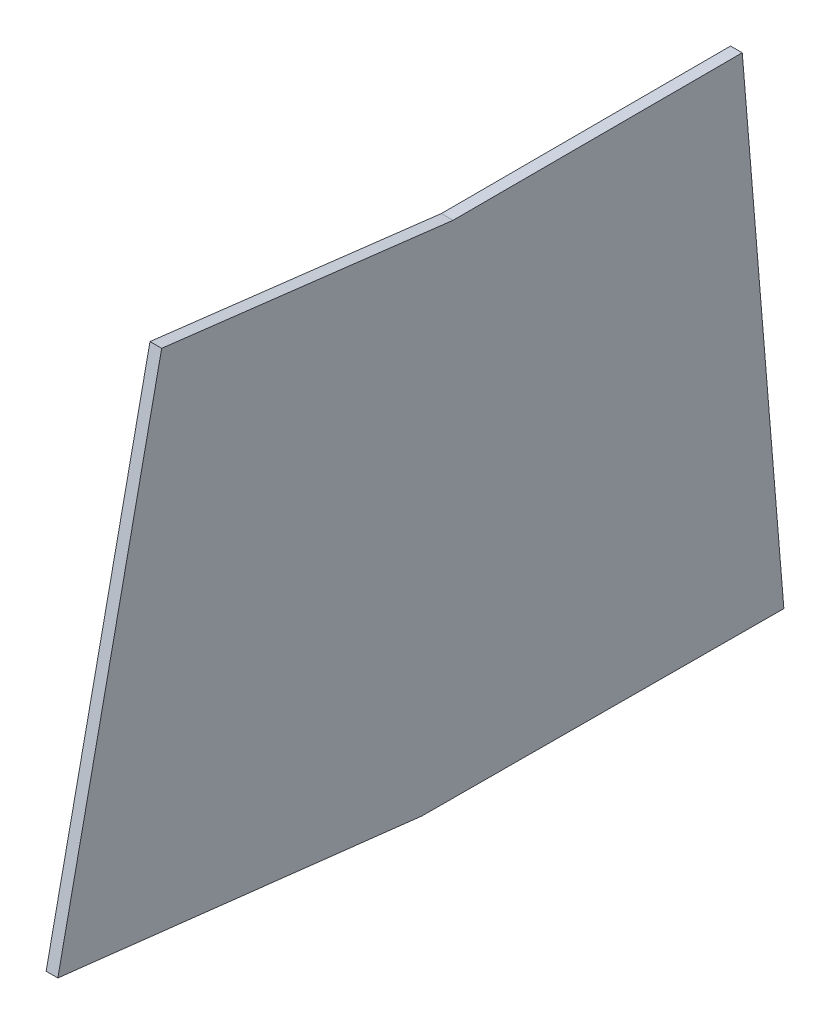
ISO-10303-21;
HEADER;
FILE_DESCRIPTION(('STEP AP214'),'2;1');
FILE_NAME('part.step','',(''),(''),'','','');
FILE_SCHEMA(('AUTOMOTIVE_DESIGN { 1 0 10303 214 1 1 1 1 }'));
ENDSEC;
DATA;
#1=APPLICATION_CONTEXT('core data for automotive mechanical design processes');
#2=APPLICATION_PROTOCOL_DEFINITION('international standard','automotive_design',2000,#1);
#3=PRODUCT_CONTEXT('',#1,'mechanical');
#4=PRODUCT('Part','Part','',(#3));
#5=PRODUCT_RELATED_PRODUCT_CATEGORY('part','',(#4));
#6=PRODUCT_DEFINITION_FORMATION('','',#4);
#7=PRODUCT_DEFINITION_CONTEXT('part definition',#1,'design');
#8=PRODUCT_DEFINITION('design','',#6,#7);
#9=PRODUCT_DEFINITION_SHAPE('','',#8);
#10=(LENGTH_UNIT() NAMED_UNIT(*) SI_UNIT(.MILLI.,.METRE.));
#11=(NAMED_UNIT(*) PLANE_ANGLE_UNIT() SI_UNIT($,.RADIAN.));
#12=(NAMED_UNIT(*) SI_UNIT($,.STERADIAN.) SOLID_ANGLE_UNIT());
#13=UNCERTAINTY_MEASURE_WITH_UNIT(LENGTH_MEASURE(1.E-05),#10,'distance_accuracy_value','');
#14=(GEOMETRIC_REPRESENTATION_CONTEXT(3) GLOBAL_UNCERTAINTY_ASSIGNED_CONTEXT((#13)) GLOBAL_UNIT_ASSIGNED_CONTEXT((#10,
#11,#12)) REPRESENTATION_CONTEXT('',''));
#15=CARTESIAN_POINT('',(0.,0.,0.));
#16=DIRECTION('',(0.,0.,1.));
#17=DIRECTION('',(1.,0.,0.));
#18=AXIS2_PLACEMENT_3D('',#15,#16,#17);
#19=CARTESIAN_POINT('',(10.,200.385133460209,-293.317457845274));
#20=DIRECTION('',(0.,-0.0825840833739609,0.996584100401608));
#21=DIRECTION('',(0.,-0.996584100401608,-0.0825840833739609));
#22=AXIS2_PLACEMENT_3D('',#19,#20,#21);
#23=PLANE('',#22);
#24=DIRECTION('',(0.,0.996584100401608,0.0825840833739608));
#25=VECTOR('',#24,1.);
#26=CARTESIAN_POINT('',(0.,200.385133460209,-293.317457845274));
#27=LINE('',#26,#25);
#28=CARTESIAN_POINT('',(0.,-228.582050482797,-328.864745494321));
#29=VERTEX_POINT('',#28);
#30=CARTESIAN_POINT('',(0.,200.385133460209,-293.317457845274));
#31=VERTEX_POINT('',#30);
#32=EDGE_CURVE('E128',#29,#31,#27,.T.);
#33=ORIENTED_EDGE('',*,*,#32,.T.);
#34=DIRECTION('',(-1.,0.,0.));
#35=VECTOR('',#34,1.);
#36=CARTESIAN_POINT('',(10.,200.385133460209,-293.317457845274));
#37=LINE('',#36,#35);
#38=CARTESIAN_POINT('',(10.,200.385133460209,-293.317457845274));
#39=VERTEX_POINT('',#38);
#40=EDGE_CURVE('E11',#39,#31,#37,.T.);
#41=ORIENTED_EDGE('',*,*,#40,.F.);
#42=DIRECTION('',(0.,0.996584100401608,0.0825840833739608));
#43=VECTOR('',#42,1.);
#44=CARTESIAN_POINT('',(10.,200.385133460209,-293.317457845274));
#45=LINE('',#44,#43);
#46=CARTESIAN_POINT('',(10.,-228.582050482797,-328.864745494321));
#47=VERTEX_POINT('',#46);
#48=EDGE_CURVE('E144',#47,#39,#45,.T.);
#49=ORIENTED_EDGE('',*,*,#48,.F.);
#50=DIRECTION('',(-1.,0.,0.));
#51=VECTOR('',#50,1.);
#52=CARTESIAN_POINT('',(10.,-228.582050482797,-328.864745494321));
#53=LINE('',#52,#51);
#54=EDGE_CURVE('E124',#47,#29,#53,.T.);
#55=ORIENTED_EDGE('',*,*,#54,.T.);
#56=EDGE_LOOP('',(#33,#41,#49,#55));
#57=FACE_BOUND('',#56,.T.);
#58=ADVANCED_FACE('F39',(#57),#23,.F.);
#59=CARTESIAN_POINT('',(10.,199.964428641835,-46.3116391899644));
#60=DIRECTION('',(0.,-0.999998549526951,-0.00170321578027254));
#61=DIRECTION('',(0.,0.00170321578027254,-0.999998549526951));
#62=AXIS2_PLACEMENT_3D('',#59,#60,#61);
#63=PLANE('',#62);
#64=DIRECTION('',(0.,-0.00170321578027254,0.999998549526951));
#65=VECTOR('',#64,1.);
#66=CARTESIAN_POINT('',(0.,199.964428641835,-46.3116391899644));
#67=LINE('',#66,#65);
#68=CARTESIAN_POINT('',(0.,199.964428641835,-46.3116391899644));
#69=VERTEX_POINT('',#68);
#70=EDGE_CURVE('E132',#31,#69,#67,.T.);
#71=ORIENTED_EDGE('',*,*,#70,.T.);
#72=DIRECTION('',(-1.,0.,0.));
#73=VECTOR('',#72,1.);
#74=CARTESIAN_POINT('',(10.,199.964428641835,-46.3116391899644));
#75=LINE('',#74,#73);
#76=CARTESIAN_POINT('',(10.,199.964428641835,-46.3116391899644));
#77=VERTEX_POINT('',#76);
#78=EDGE_CURVE('E48',#77,#69,#75,.T.);
#79=ORIENTED_EDGE('',*,*,#78,.F.);
#80=DIRECTION('',(0.,-0.00170321578027254,0.999998549526951));
#81=VECTOR('',#80,1.);
#82=CARTESIAN_POINT('',(10.,199.964428641835,-46.3116391899644));
#83=LINE('',#82,#81);
#84=EDGE_CURVE('E93',#39,#77,#83,.T.);
#85=ORIENTED_EDGE('',*,*,#84,.F.);
#86=ORIENTED_EDGE('',*,*,#40,.T.);
#87=EDGE_LOOP('',(#71,#79,#85,#86));
#88=FACE_BOUND('',#87,.T.);
#89=ADVANCED_FACE('F172',(#88),#63,.F.);
#90=CARTESIAN_POINT('',(10.,229.705795793054,202.589751500776));
#91=DIRECTION('',(0.,-0.99293655229067,0.118646547042538));
#92=DIRECTION('',(0.,-0.118646547042538,-0.99293655229067));
#93=AXIS2_PLACEMENT_3D('',#90,#91,#92);
#94=PLANE('',#93);
#95=DIRECTION('',(0.,0.118646547042538,0.99293655229067));
#96=VECTOR('',#95,1.);
#97=CARTESIAN_POINT('',(0.,229.705795793054,202.589751500776));
#98=LINE('',#97,#96);
#99=CARTESIAN_POINT('',(0.,229.705795793054,202.589751500776));
#100=VERTEX_POINT('',#99);
#101=EDGE_CURVE('E135',#69,#100,#98,.T.);
#102=ORIENTED_EDGE('',*,*,#101,.T.);
#103=DIRECTION('',(-1.,0.,0.));
#104=VECTOR('',#103,1.);
#105=CARTESIAN_POINT('',(10.,229.705795793054,202.589751500776));
#106=LINE('',#105,#104);
#107=CARTESIAN_POINT('',(10.,229.705795793054,202.589751500776));
#108=VERTEX_POINT('',#107);
#109=EDGE_CURVE('E117',#108,#100,#106,.T.);
#110=ORIENTED_EDGE('',*,*,#109,.F.);
#111=DIRECTION('',(0.,0.118646547042538,0.99293655229067));
#112=VECTOR('',#111,1.);
#113=CARTESIAN_POINT('',(10.,229.705795793054,202.589751500776));
#114=LINE('',#113,#112);
#115=EDGE_CURVE('E106',#77,#108,#114,.T.);
#116=ORIENTED_EDGE('',*,*,#115,.F.);
#117=ORIENTED_EDGE('',*,*,#78,.T.);
#118=EDGE_LOOP('',(#102,#110,#116,#117));
#119=FACE_BOUND('',#118,.T.);
#120=ADVANCED_FACE('F154',(#119),#94,.F.);
#121=CARTESIAN_POINT('',(10.,-191.735889362679,291.281707895705));
#122=DIRECTION('',(0.,-0.205937977777171,-0.978565046028648));
#123=DIRECTION('',(0.,0.978565046028648,-0.205937977777171));
#124=AXIS2_PLACEMENT_3D('',#121,#122,#123);
#125=PLANE('',#124);
#126=DIRECTION('',(0.,-0.978565046028648,0.205937977777171));
#127=VECTOR('',#126,1.);
#128=CARTESIAN_POINT('',(0.,-191.735889362679,291.281707895705));
#129=LINE('',#128,#127);
#130=CARTESIAN_POINT('',(0.,-191.735889362679,291.281707895705));
#131=VERTEX_POINT('',#130);
#132=EDGE_CURVE('E115',#100,#131,#129,.T.);
#133=ORIENTED_EDGE('',*,*,#132,.T.);
#134=DIRECTION('',(-1.,0.,0.));
#135=VECTOR('',#134,1.);
#136=CARTESIAN_POINT('',(10.,-191.735889362679,291.281707895705));
#137=LINE('',#136,#135);
#138=CARTESIAN_POINT('',(10.,-191.735889362679,291.281707895705));
#139=VERTEX_POINT('',#138);
#140=EDGE_CURVE('E112',#139,#131,#137,.T.);
#141=ORIENTED_EDGE('',*,*,#140,.F.);
#142=DIRECTION('',(0.,-0.978565046028648,0.205937977777171));
#143=VECTOR('',#142,1.);
#144=CARTESIAN_POINT('',(10.,-191.735889362679,291.281707895705));
#145=LINE('',#144,#143);
#146=EDGE_CURVE('E100',#108,#139,#145,.T.);
#147=ORIENTED_EDGE('',*,*,#146,.F.);
#148=ORIENTED_EDGE('',*,*,#109,.T.);
#149=EDGE_LOOP('',(#133,#141,#147,#148));
#150=FACE_BOUND('',#149,.T.);
#151=ADVANCED_FACE('F113',(#150),#125,.F.);
#152=CARTESIAN_POINT('',(10.,-227.382384297313,-19.8155335461667));
#153=DIRECTION('',(0.,0.993499296081713,-0.113838256685269));
#154=DIRECTION('',(0.,0.113838256685269,0.993499296081713));
#155=AXIS2_PLACEMENT_3D('',#152,#153,#154);
#156=PLANE('',#155);
#157=DIRECTION('',(0.,-0.113838256685269,-0.993499296081713));
#158=VECTOR('',#157,1.);
#159=CARTESIAN_POINT('',(0.,-227.382384297313,-19.8155335461667));
#160=LINE('',#159,#158);
#161=CARTESIAN_POINT('',(0.,-227.382384297313,-19.8155335461667));
#162=VERTEX_POINT('',#161);
#163=EDGE_CURVE('E79',#131,#162,#160,.T.);
#164=ORIENTED_EDGE('',*,*,#163,.T.);
#165=DIRECTION('',(-1.,0.,0.));
#166=VECTOR('',#165,1.);
#167=CARTESIAN_POINT('',(10.,-227.382384297313,-19.8155335461667));
#168=LINE('',#167,#166);
#169=CARTESIAN_POINT('',(10.,-227.382384297313,-19.8155335461667));
#170=VERTEX_POINT('',#169);
#171=EDGE_CURVE('E118',#170,#162,#168,.T.);
#172=ORIENTED_EDGE('',*,*,#171,.F.);
#173=DIRECTION('',(0.,-0.113838256685269,-0.993499296081713));
#174=VECTOR('',#173,1.);
#175=CARTESIAN_POINT('',(10.,-227.382384297313,-19.8155335461667));
#176=LINE('',#175,#174);
#177=EDGE_CURVE('E104',#139,#170,#176,.T.);
#178=ORIENTED_EDGE('',*,*,#177,.F.);
#179=ORIENTED_EDGE('',*,*,#140,.T.);
#180=EDGE_LOOP('',(#164,#172,#178,#179));
#181=FACE_BOUND('',#180,.T.);
#182=ADVANCED_FACE('F120',(#181),#156,.F.);
#183=CARTESIAN_POINT('',(10.,-228.582050482797,-328.864745494321));
#184=DIRECTION('',(0.,0.999992465912656,-0.00388176737138978));
#185=DIRECTION('',(0.,0.00388176737138978,0.999992465912656));
#186=AXIS2_PLACEMENT_3D('',#183,#184,#185);
#187=PLANE('',#186);
#188=DIRECTION('',(0.,-0.00388176737138978,-0.999992465912656));
#189=VECTOR('',#188,1.);
#190=CARTESIAN_POINT('',(0.,-228.582050482797,-328.864745494321));
#191=LINE('',#190,#189);
#192=EDGE_CURVE('E85',#162,#29,#191,.T.);
#193=ORIENTED_EDGE('',*,*,#192,.T.);
#194=ORIENTED_EDGE('',*,*,#54,.F.);
#195=DIRECTION('',(0.,-0.00388176737138978,-0.999992465912656));
#196=VECTOR('',#195,1.);
#197=CARTESIAN_POINT('',(10.,-228.582050482797,-328.864745494321));
#198=LINE('',#197,#196);
#199=EDGE_CURVE('E56',#170,#47,#198,.T.);
#200=ORIENTED_EDGE('',*,*,#199,.F.);
#201=ORIENTED_EDGE('',*,*,#171,.T.);
#202=EDGE_LOOP('',(#193,#194,#200,#201));
#203=FACE_BOUND('',#202,.T.);
#204=ADVANCED_FACE('F161',(#203),#187,.F.);
#205=CARTESIAN_POINT('',(10.,0.,0.));
#206=DIRECTION('',(1.,0.,0.));
#207=DIRECTION('',(0.,0.,-1.));
#208=AXIS2_PLACEMENT_3D('',#205,#206,#207);
#209=PLANE('',#208);
#210=ORIENTED_EDGE('',*,*,#48,.T.);
#211=ORIENTED_EDGE('',*,*,#84,.T.);
#212=ORIENTED_EDGE('',*,*,#115,.T.);
#213=ORIENTED_EDGE('',*,*,#146,.T.);
#214=ORIENTED_EDGE('',*,*,#177,.T.);
#215=ORIENTED_EDGE('',*,*,#199,.T.);
#216=EDGE_LOOP('',(#210,#211,#212,#213,#214,#215));
#217=FACE_BOUND('',#216,.T.);
#218=ADVANCED_FACE('F102',(#217),#209,.T.);
#219=CARTESIAN_POINT('',(0.,0.,0.));
#220=DIRECTION('',(1.,0.,0.));
#221=DIRECTION('',(0.,0.,-1.));
#222=AXIS2_PLACEMENT_3D('',#219,#220,#221);
#223=PLANE('',#222);
#224=ORIENTED_EDGE('',*,*,#32,.F.);
#225=ORIENTED_EDGE('',*,*,#192,.F.);
#226=ORIENTED_EDGE('',*,*,#163,.F.);
#227=ORIENTED_EDGE('',*,*,#132,.F.);
#228=ORIENTED_EDGE('',*,*,#101,.F.);
#229=ORIENTED_EDGE('',*,*,#70,.F.);
#230=EDGE_LOOP('',(#224,#225,#226,#227,#228,#229));
#231=FACE_BOUND('',#230,.T.);
#232=ADVANCED_FACE('F157',(#231),#223,.F.);
#233=CLOSED_SHELL('',(#58,#89,#120,#151,#182,#204,#218,#232));
#234=MANIFOLD_SOLID_BREP('B2',#233);
#235=ADVANCED_BREP_SHAPE_REPRESENTATION('',(#18,#234),#14);
#236=SHAPE_DEFINITION_REPRESENTATION(#9,#235);
ENDSEC;
END-ISO-10303-21;
